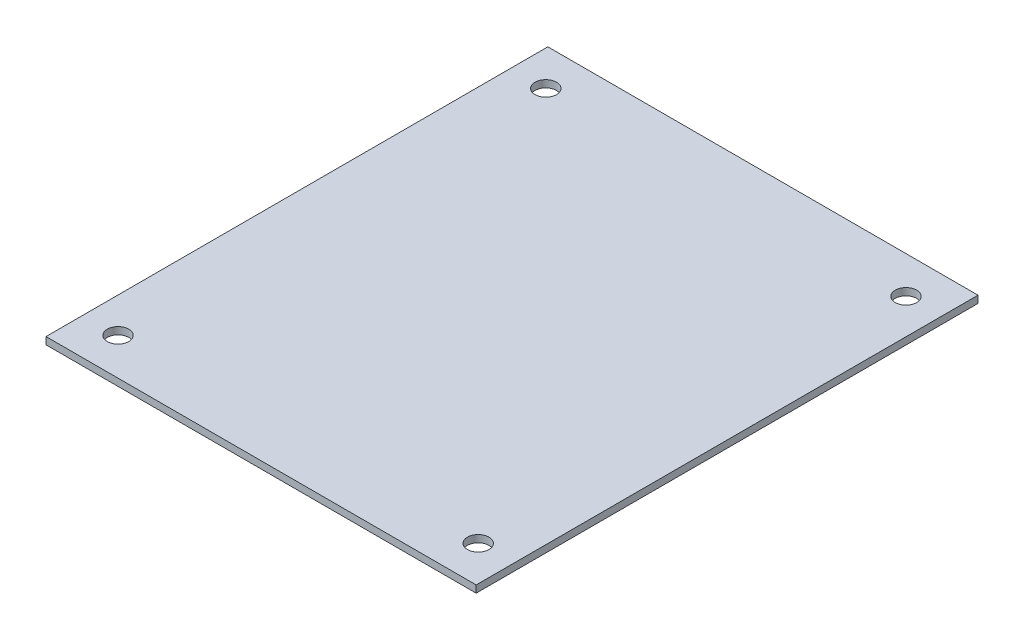
ISO-10303-21;
HEADER;
FILE_DESCRIPTION(('STEP AP214'),'2;1');
FILE_NAME('part.step','',(''),(''),'','','');
FILE_SCHEMA(('AUTOMOTIVE_DESIGN { 1 0 10303 214 1 1 1 1 }'));
ENDSEC;
DATA;
#1=APPLICATION_CONTEXT('core data for automotive mechanical design processes');
#2=APPLICATION_PROTOCOL_DEFINITION('international standard','automotive_design',2000,#1);
#3=PRODUCT_CONTEXT('',#1,'mechanical');
#4=PRODUCT('Part','Part','',(#3));
#5=PRODUCT_RELATED_PRODUCT_CATEGORY('part','',(#4));
#6=PRODUCT_DEFINITION_FORMATION('','',#4);
#7=PRODUCT_DEFINITION_CONTEXT('part definition',#1,'design');
#8=PRODUCT_DEFINITION('design','',#6,#7);
#9=PRODUCT_DEFINITION_SHAPE('','',#8);
#10=(LENGTH_UNIT() NAMED_UNIT(*) SI_UNIT(.MILLI.,.METRE.));
#11=(NAMED_UNIT(*) PLANE_ANGLE_UNIT() SI_UNIT($,.RADIAN.));
#12=(NAMED_UNIT(*) SI_UNIT($,.STERADIAN.) SOLID_ANGLE_UNIT());
#13=UNCERTAINTY_MEASURE_WITH_UNIT(LENGTH_MEASURE(1.E-05),#10,'distance_accuracy_value','');
#14=(GEOMETRIC_REPRESENTATION_CONTEXT(3) GLOBAL_UNCERTAINTY_ASSIGNED_CONTEXT((#13)) GLOBAL_UNIT_ASSIGNED_CONTEXT((#10,
#11,#12)) REPRESENTATION_CONTEXT('',''));
#15=CARTESIAN_POINT('',(0.,0.,0.));
#16=DIRECTION('',(0.,0.,1.));
#17=DIRECTION('',(1.,0.,0.));
#18=AXIS2_PLACEMENT_3D('',#15,#16,#17);
#19=CARTESIAN_POINT('',(30.,1.,-35.));
#20=DIRECTION('',(-1.,0.,0.));
#21=DIRECTION('',(0.,0.,1.));
#22=AXIS2_PLACEMENT_3D('',#19,#20,#21);
#23=PLANE('',#22);
#24=DIRECTION('',(0.,0.,-1.));
#25=VECTOR('',#24,1.);
#26=CARTESIAN_POINT('',(30.,0.,-35.));
#27=LINE('',#26,#25);
#28=CARTESIAN_POINT('',(30.,0.,35.));
#29=VERTEX_POINT('',#28);
#30=CARTESIAN_POINT('',(30.,0.,-35.));
#31=VERTEX_POINT('',#30);
#32=EDGE_CURVE('E95',#29,#31,#27,.T.);
#33=ORIENTED_EDGE('',*,*,#32,.T.);
#34=DIRECTION('',(0.,-1.,0.));
#35=VECTOR('',#34,1.);
#36=CARTESIAN_POINT('',(30.,1.,-35.));
#37=LINE('',#36,#35);
#38=CARTESIAN_POINT('',(30.,1.,-35.));
#39=VERTEX_POINT('',#38);
#40=EDGE_CURVE('E11',#39,#31,#37,.T.);
#41=ORIENTED_EDGE('',*,*,#40,.F.);
#42=DIRECTION('',(0.,0.,-1.));
#43=VECTOR('',#42,1.);
#44=CARTESIAN_POINT('',(30.,1.,-35.));
#45=LINE('',#44,#43);
#46=CARTESIAN_POINT('',(30.,1.,35.));
#47=VERTEX_POINT('',#46);
#48=EDGE_CURVE('E83',#47,#39,#45,.T.);
#49=ORIENTED_EDGE('',*,*,#48,.F.);
#50=DIRECTION('',(0.,-1.,0.));
#51=VECTOR('',#50,1.);
#52=CARTESIAN_POINT('',(30.,1.,35.));
#53=LINE('',#52,#51);
#54=EDGE_CURVE('E91',#47,#29,#53,.T.);
#55=ORIENTED_EDGE('',*,*,#54,.T.);
#56=EDGE_LOOP('',(#33,#41,#49,#55));
#57=FACE_BOUND('',#56,.T.);
#58=ADVANCED_FACE('F32',(#57),#23,.F.);
#59=CARTESIAN_POINT('',(-30.,1.,-35.));
#60=DIRECTION('',(0.,0.,1.));
#61=DIRECTION('',(1.,0.,0.));
#62=AXIS2_PLACEMENT_3D('',#59,#60,#61);
#63=PLANE('',#62);
#64=DIRECTION('',(-1.,0.,0.));
#65=VECTOR('',#64,1.);
#66=CARTESIAN_POINT('',(-30.,0.,-35.));
#67=LINE('',#66,#65);
#68=CARTESIAN_POINT('',(-30.,0.,-35.));
#69=VERTEX_POINT('',#68);
#70=EDGE_CURVE('E87',#31,#69,#67,.T.);
#71=ORIENTED_EDGE('',*,*,#70,.T.);
#72=DIRECTION('',(0.,-1.,0.));
#73=VECTOR('',#72,1.);
#74=CARTESIAN_POINT('',(-30.,1.,-35.));
#75=LINE('',#74,#73);
#76=CARTESIAN_POINT('',(-30.,1.,-35.));
#77=VERTEX_POINT('',#76);
#78=EDGE_CURVE('E40',#77,#69,#75,.T.);
#79=ORIENTED_EDGE('',*,*,#78,.F.);
#80=DIRECTION('',(-1.,0.,0.));
#81=VECTOR('',#80,1.);
#82=CARTESIAN_POINT('',(-30.,1.,-35.));
#83=LINE('',#82,#81);
#84=EDGE_CURVE('E78',#39,#77,#83,.T.);
#85=ORIENTED_EDGE('',*,*,#84,.F.);
#86=ORIENTED_EDGE('',*,*,#40,.T.);
#87=EDGE_LOOP('',(#71,#79,#85,#86));
#88=FACE_BOUND('',#87,.T.);
#89=ADVANCED_FACE('F86',(#88),#63,.F.);
#90=CARTESIAN_POINT('',(-30.,1.,-35.));
#91=DIRECTION('',(1.,0.,0.));
#92=DIRECTION('',(0.,0.,-1.));
#93=AXIS2_PLACEMENT_3D('',#90,#91,#92);
#94=PLANE('',#93);
#95=DIRECTION('',(0.,0.,1.));
#96=VECTOR('',#95,1.);
#97=CARTESIAN_POINT('',(-30.,0.,-35.));
#98=LINE('',#97,#96);
#99=CARTESIAN_POINT('',(-30.,0.,35.));
#100=VERTEX_POINT('',#99);
#101=EDGE_CURVE('E65',#69,#100,#98,.T.);
#102=ORIENTED_EDGE('',*,*,#101,.T.);
#103=DIRECTION('',(0.,-1.,0.));
#104=VECTOR('',#103,1.);
#105=CARTESIAN_POINT('',(-30.,1.,35.));
#106=LINE('',#105,#104);
#107=CARTESIAN_POINT('',(-30.,1.,35.));
#108=VERTEX_POINT('',#107);
#109=EDGE_CURVE('E88',#108,#100,#106,.T.);
#110=ORIENTED_EDGE('',*,*,#109,.F.);
#111=DIRECTION('',(0.,0.,1.));
#112=VECTOR('',#111,1.);
#113=CARTESIAN_POINT('',(-30.,1.,-35.));
#114=LINE('',#113,#112);
#115=EDGE_CURVE('E81',#77,#108,#114,.T.);
#116=ORIENTED_EDGE('',*,*,#115,.F.);
#117=ORIENTED_EDGE('',*,*,#78,.T.);
#118=EDGE_LOOP('',(#102,#110,#116,#117));
#119=FACE_BOUND('',#118,.T.);
#120=ADVANCED_FACE('F89',(#119),#94,.F.);
#121=CARTESIAN_POINT('',(-30.,1.,35.));
#122=DIRECTION('',(0.,0.,-1.));
#123=DIRECTION('',(-1.,0.,0.));
#124=AXIS2_PLACEMENT_3D('',#121,#122,#123);
#125=PLANE('',#124);
#126=DIRECTION('',(1.,0.,0.));
#127=VECTOR('',#126,1.);
#128=CARTESIAN_POINT('',(-30.,0.,35.));
#129=LINE('',#128,#127);
#130=EDGE_CURVE('E71',#100,#29,#129,.T.);
#131=ORIENTED_EDGE('',*,*,#130,.T.);
#132=ORIENTED_EDGE('',*,*,#54,.F.);
#133=DIRECTION('',(1.,0.,0.));
#134=VECTOR('',#133,1.);
#135=CARTESIAN_POINT('',(-30.,1.,35.));
#136=LINE('',#135,#134);
#137=EDGE_CURVE('E48',#108,#47,#136,.T.);
#138=ORIENTED_EDGE('',*,*,#137,.F.);
#139=ORIENTED_EDGE('',*,*,#109,.T.);
#140=EDGE_LOOP('',(#131,#132,#138,#139));
#141=FACE_BOUND('',#140,.T.);
#142=ADVANCED_FACE('F103',(#141),#125,.F.);
#143=CARTESIAN_POINT('',(0.,1.,0.));
#144=DIRECTION('',(0.,1.,0.));
#145=DIRECTION('',(0.,0.,1.));
#146=AXIS2_PLACEMENT_3D('',#143,#144,#145);
#147=PLANE('',#146);
#148=CARTESIAN_POINT('',(-25.1192919963117,1.,29.8326096609287));
#149=DIRECTION('',(0.,1.,0.));
#150=DIRECTION('',(0.,0.,-1.));
#151=AXIS2_PLACEMENT_3D('',#148,#149,#150);
#152=CIRCLE('',#151,1.5);
#153=CARTESIAN_POINT('',(-25.1192919963117,1.,28.3326096609287));
#154=VERTEX_POINT('',#153);
#155=EDGE_CURVE('E122',#154,#154,#152,.T.);
#156=ORIENTED_EDGE('',*,*,#155,.F.);
#157=EDGE_LOOP('',(#156));
#158=FACE_BOUND('',#157,.T.);
#159=CARTESIAN_POINT('',(25.1192919963117,1.,-29.8326096609287));
#160=DIRECTION('',(0.,1.,0.));
#161=DIRECTION('',(0.,0.,-1.));
#162=AXIS2_PLACEMENT_3D('',#159,#160,#161);
#163=CIRCLE('',#162,1.5);
#164=CARTESIAN_POINT('',(25.1192919963117,1.,-31.3326096609287));
#165=VERTEX_POINT('',#164);
#166=EDGE_CURVE('E115',#165,#165,#163,.T.);
#167=ORIENTED_EDGE('',*,*,#166,.F.);
#168=EDGE_LOOP('',(#167));
#169=FACE_BOUND('',#168,.T.);
#170=CARTESIAN_POINT('',(25.1192919963117,1.,29.8326096609287));
#171=DIRECTION('',(0.,1.,0.));
#172=DIRECTION('',(0.,0.,1.));
#173=AXIS2_PLACEMENT_3D('',#170,#171,#172);
#174=CIRCLE('',#173,1.5);
#175=CARTESIAN_POINT('',(25.1192919963117,1.,31.3326096609287));
#176=VERTEX_POINT('',#175);
#177=EDGE_CURVE('E127',#176,#176,#174,.T.);
#178=ORIENTED_EDGE('',*,*,#177,.F.);
#179=EDGE_LOOP('',(#178));
#180=FACE_BOUND('',#179,.T.);
#181=CARTESIAN_POINT('',(-25.1192919963117,1.,-29.8326096609287));
#182=DIRECTION('',(0.,1.,0.));
#183=DIRECTION('',(0.,0.,1.));
#184=AXIS2_PLACEMENT_3D('',#181,#182,#183);
#185=CIRCLE('',#184,1.5);
#186=CARTESIAN_POINT('',(-25.1192919963117,1.,-28.3326096609287));
#187=VERTEX_POINT('',#186);
#188=EDGE_CURVE('E109',#187,#187,#185,.T.);
#189=ORIENTED_EDGE('',*,*,#188,.F.);
#190=EDGE_LOOP('',(#189));
#191=FACE_BOUND('',#190,.T.);
#192=ORIENTED_EDGE('',*,*,#48,.T.);
#193=ORIENTED_EDGE('',*,*,#84,.T.);
#194=ORIENTED_EDGE('',*,*,#115,.T.);
#195=ORIENTED_EDGE('',*,*,#137,.T.);
#196=EDGE_LOOP('',(#192,#193,#194,#195));
#197=FACE_BOUND('',#196,.T.);
#198=ADVANCED_FACE('F79',(#158,#169,#180,#191,#197),#147,.T.);
#199=CARTESIAN_POINT('',(0.,0.,0.));
#200=DIRECTION('',(0.,1.,0.));
#201=DIRECTION('',(0.,0.,1.));
#202=AXIS2_PLACEMENT_3D('',#199,#200,#201);
#203=PLANE('',#202);
#204=CARTESIAN_POINT('',(-25.1192919963117,0.,29.8326096609287));
#205=DIRECTION('',(0.,1.,0.));
#206=DIRECTION('',(0.,0.,-1.));
#207=AXIS2_PLACEMENT_3D('',#204,#205,#206);
#208=CIRCLE('',#207,1.5);
#209=CARTESIAN_POINT('',(-25.1192919963117,0.,28.3326096609287));
#210=VERTEX_POINT('',#209);
#211=EDGE_CURVE('E112',#210,#210,#208,.T.);
#212=ORIENTED_EDGE('',*,*,#211,.T.);
#213=EDGE_LOOP('',(#212));
#214=FACE_BOUND('',#213,.T.);
#215=CARTESIAN_POINT('',(25.1192919963117,0.,-29.8326096609287));
#216=DIRECTION('',(0.,1.,0.));
#217=DIRECTION('',(0.,0.,-1.));
#218=AXIS2_PLACEMENT_3D('',#215,#216,#217);
#219=CIRCLE('',#218,1.5);
#220=CARTESIAN_POINT('',(25.1192919963117,0.,-31.3326096609287));
#221=VERTEX_POINT('',#220);
#222=EDGE_CURVE('E118',#221,#221,#219,.T.);
#223=ORIENTED_EDGE('',*,*,#222,.T.);
#224=EDGE_LOOP('',(#223));
#225=FACE_BOUND('',#224,.T.);
#226=CARTESIAN_POINT('',(25.1192919963117,0.,29.8326096609287));
#227=DIRECTION('',(0.,1.,0.));
#228=DIRECTION('',(0.,0.,1.));
#229=AXIS2_PLACEMENT_3D('',#226,#227,#228);
#230=CIRCLE('',#229,1.5);
#231=CARTESIAN_POINT('',(25.1192919963117,0.,31.3326096609287));
#232=VERTEX_POINT('',#231);
#233=EDGE_CURVE('E119',#232,#232,#230,.T.);
#234=ORIENTED_EDGE('',*,*,#233,.T.);
#235=EDGE_LOOP('',(#234));
#236=FACE_BOUND('',#235,.T.);
#237=CARTESIAN_POINT('',(-25.1192919963117,0.,-29.8326096609287));
#238=DIRECTION('',(0.,1.,0.));
#239=DIRECTION('',(0.,0.,1.));
#240=AXIS2_PLACEMENT_3D('',#237,#238,#239);
#241=CIRCLE('',#240,1.5);
#242=CARTESIAN_POINT('',(-25.1192919963117,0.,-28.3326096609287));
#243=VERTEX_POINT('',#242);
#244=EDGE_CURVE('E98',#243,#243,#241,.T.);
#245=ORIENTED_EDGE('',*,*,#244,.T.);
#246=EDGE_LOOP('',(#245));
#247=FACE_BOUND('',#246,.T.);
#248=ORIENTED_EDGE('',*,*,#32,.F.);
#249=ORIENTED_EDGE('',*,*,#130,.F.);
#250=ORIENTED_EDGE('',*,*,#101,.F.);
#251=ORIENTED_EDGE('',*,*,#70,.F.);
#252=EDGE_LOOP('',(#248,#249,#250,#251));
#253=FACE_BOUND('',#252,.T.);
#254=ADVANCED_FACE('F106',(#214,#225,#236,#247,#253),#203,.F.);
#255=CARTESIAN_POINT('',(-25.1192919963117,0.,-29.8326096609287));
#256=DIRECTION('',(0.,1.,0.));
#257=DIRECTION('',(0.,0.,1.));
#258=AXIS2_PLACEMENT_3D('',#255,#256,#257);
#259=CYLINDRICAL_SURFACE('',#258,1.5);
#260=ORIENTED_EDGE('',*,*,#244,.F.);
#261=EDGE_LOOP('',(#260));
#262=FACE_BOUND('',#261,.T.);
#263=ORIENTED_EDGE('',*,*,#188,.T.);
#264=EDGE_LOOP('',(#263));
#265=FACE_BOUND('',#264,.T.);
#266=ADVANCED_FACE('F139',(#262,#265),#259,.F.);
#267=CARTESIAN_POINT('',(25.1192919963117,0.,29.8326096609287));
#268=DIRECTION('',(0.,1.,0.));
#269=DIRECTION('',(0.,0.,1.));
#270=AXIS2_PLACEMENT_3D('',#267,#268,#269);
#271=CYLINDRICAL_SURFACE('',#270,1.5);
#272=ORIENTED_EDGE('',*,*,#233,.F.);
#273=EDGE_LOOP('',(#272));
#274=FACE_BOUND('',#273,.T.);
#275=ORIENTED_EDGE('',*,*,#177,.T.);
#276=EDGE_LOOP('',(#275));
#277=FACE_BOUND('',#276,.T.);
#278=ADVANCED_FACE('F135',(#274,#277),#271,.F.);
#279=CARTESIAN_POINT('',(25.1192919963117,0.,-29.8326096609287));
#280=DIRECTION('',(0.,1.,0.));
#281=DIRECTION('',(0.,0.,1.));
#282=AXIS2_PLACEMENT_3D('',#279,#280,#281);
#283=CYLINDRICAL_SURFACE('',#282,1.5);
#284=ORIENTED_EDGE('',*,*,#222,.F.);
#285=EDGE_LOOP('',(#284));
#286=FACE_BOUND('',#285,.T.);
#287=ORIENTED_EDGE('',*,*,#166,.T.);
#288=EDGE_LOOP('',(#287));
#289=FACE_BOUND('',#288,.T.);
#290=ADVANCED_FACE('F138',(#286,#289),#283,.F.);
#291=CARTESIAN_POINT('',(-25.1192919963117,0.,29.8326096609287));
#292=DIRECTION('',(0.,1.,0.));
#293=DIRECTION('',(0.,0.,1.));
#294=AXIS2_PLACEMENT_3D('',#291,#292,#293);
#295=CYLINDRICAL_SURFACE('',#294,1.5);
#296=ORIENTED_EDGE('',*,*,#211,.F.);
#297=EDGE_LOOP('',(#296));
#298=FACE_BOUND('',#297,.T.);
#299=ORIENTED_EDGE('',*,*,#155,.T.);
#300=EDGE_LOOP('',(#299));
#301=FACE_BOUND('',#300,.T.);
#302=ADVANCED_FACE('F200',(#298,#301),#295,.F.);
#303=CLOSED_SHELL('',(#58,#89,#120,#142,#198,#254,#266,#278,#290,#302));
#304=MANIFOLD_SOLID_BREP('B2',#303);
#305=ADVANCED_BREP_SHAPE_REPRESENTATION('',(#18,#304),#14);
#306=SHAPE_DEFINITION_REPRESENTATION(#9,#305);
ENDSEC;
END-ISO-10303-21;
